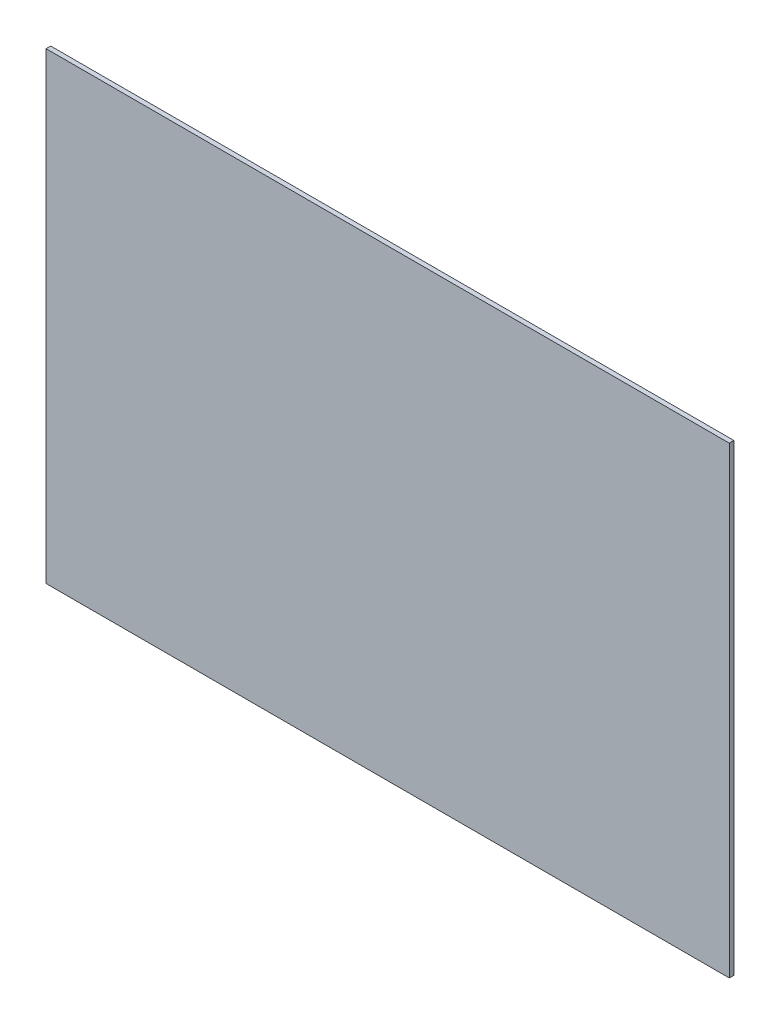
ISO-10303-21;
HEADER;
FILE_DESCRIPTION(('STEP AP214'),'2;1');
FILE_NAME('part.step','',(''),(''),'','','');
FILE_SCHEMA(('AUTOMOTIVE_DESIGN { 1 0 10303 214 1 1 1 1 }'));
ENDSEC;
DATA;
#1=APPLICATION_CONTEXT('core data for automotive mechanical design processes');
#2=APPLICATION_PROTOCOL_DEFINITION('international standard','automotive_design',2000,#1);
#3=PRODUCT_CONTEXT('',#1,'mechanical');
#4=PRODUCT('Part','Part','',(#3));
#5=PRODUCT_RELATED_PRODUCT_CATEGORY('part','',(#4));
#6=PRODUCT_DEFINITION_FORMATION('','',#4);
#7=PRODUCT_DEFINITION_CONTEXT('part definition',#1,'design');
#8=PRODUCT_DEFINITION('design','',#6,#7);
#9=PRODUCT_DEFINITION_SHAPE('','',#8);
#10=(LENGTH_UNIT() NAMED_UNIT(*) SI_UNIT(.MILLI.,.METRE.));
#11=(NAMED_UNIT(*) PLANE_ANGLE_UNIT() SI_UNIT($,.RADIAN.));
#12=(NAMED_UNIT(*) SI_UNIT($,.STERADIAN.) SOLID_ANGLE_UNIT());
#13=UNCERTAINTY_MEASURE_WITH_UNIT(LENGTH_MEASURE(1.E-05),#10,'distance_accuracy_value','');
#14=(GEOMETRIC_REPRESENTATION_CONTEXT(3) GLOBAL_UNCERTAINTY_ASSIGNED_CONTEXT((#13)) GLOBAL_UNIT_ASSIGNED_CONTEXT((#10,
#11,#12)) REPRESENTATION_CONTEXT('',''));
#15=CARTESIAN_POINT('',(0.,0.,0.));
#16=DIRECTION('',(0.,0.,1.));
#17=DIRECTION('',(1.,0.,0.));
#18=AXIS2_PLACEMENT_3D('',#15,#16,#17);
#19=CARTESIAN_POINT('',(0.,0.,2.));
#20=DIRECTION('',(1.,0.,0.));
#21=DIRECTION('',(0.,0.,-1.));
#22=AXIS2_PLACEMENT_3D('',#19,#20,#21);
#23=PLANE('',#22);
#24=DIRECTION('',(0.,-1.,0.));
#25=VECTOR('',#24,1.);
#26=CARTESIAN_POINT('',(0.,0.,0.));
#27=LINE('',#26,#25);
#28=CARTESIAN_POINT('',(0.,200.,0.));
#29=VERTEX_POINT('',#28);
#30=CARTESIAN_POINT('',(0.,0.,0.));
#31=VERTEX_POINT('',#30);
#32=EDGE_CURVE('E105',#29,#31,#27,.T.);
#33=ORIENTED_EDGE('',*,*,#32,.T.);
#34=DIRECTION('',(0.,0.,-1.));
#35=VECTOR('',#34,1.);
#36=CARTESIAN_POINT('',(0.,0.,2.));
#37=LINE('',#36,#35);
#38=CARTESIAN_POINT('',(0.,0.,2.));
#39=VERTEX_POINT('',#38);
#40=EDGE_CURVE('E11',#39,#31,#37,.T.);
#41=ORIENTED_EDGE('',*,*,#40,.F.);
#42=DIRECTION('',(0.,-1.,0.));
#43=VECTOR('',#42,1.);
#44=CARTESIAN_POINT('',(0.,0.,2.));
#45=LINE('',#44,#43);
#46=CARTESIAN_POINT('',(0.,200.,2.));
#47=VERTEX_POINT('',#46);
#48=EDGE_CURVE('E93',#47,#39,#45,.T.);
#49=ORIENTED_EDGE('',*,*,#48,.F.);
#50=DIRECTION('',(0.,0.,-1.));
#51=VECTOR('',#50,1.);
#52=CARTESIAN_POINT('',(0.,200.,2.));
#53=LINE('',#52,#51);
#54=EDGE_CURVE('E101',#47,#29,#53,.T.);
#55=ORIENTED_EDGE('',*,*,#54,.T.);
#56=EDGE_LOOP('',(#33,#41,#49,#55));
#57=FACE_BOUND('',#56,.T.);
#58=ADVANCED_FACE('F42',(#57),#23,.F.);
#59=CARTESIAN_POINT('',(0.,0.,2.));
#60=DIRECTION('',(0.,1.,0.));
#61=DIRECTION('',(0.,0.,1.));
#62=AXIS2_PLACEMENT_3D('',#59,#60,#61);
#63=PLANE('',#62);
#64=DIRECTION('',(1.,0.,0.));
#65=VECTOR('',#64,1.);
#66=CARTESIAN_POINT('',(0.,0.,0.));
#67=LINE('',#66,#65);
#68=CARTESIAN_POINT('',(295.,0.,0.));
#69=VERTEX_POINT('',#68);
#70=EDGE_CURVE('E97',#31,#69,#67,.T.);
#71=ORIENTED_EDGE('',*,*,#70,.T.);
#72=DIRECTION('',(0.,0.,-1.));
#73=VECTOR('',#72,1.);
#74=CARTESIAN_POINT('',(295.,0.,2.));
#75=LINE('',#74,#73);
#76=CARTESIAN_POINT('',(295.,0.,2.));
#77=VERTEX_POINT('',#76);
#78=EDGE_CURVE('E50',#77,#69,#75,.T.);
#79=ORIENTED_EDGE('',*,*,#78,.F.);
#80=DIRECTION('',(1.,0.,0.));
#81=VECTOR('',#80,1.);
#82=CARTESIAN_POINT('',(0.,0.,2.));
#83=LINE('',#82,#81);
#84=EDGE_CURVE('E88',#39,#77,#83,.T.);
#85=ORIENTED_EDGE('',*,*,#84,.F.);
#86=ORIENTED_EDGE('',*,*,#40,.T.);
#87=EDGE_LOOP('',(#71,#79,#85,#86));
#88=FACE_BOUND('',#87,.T.);
#89=ADVANCED_FACE('F96',(#88),#63,.F.);
#90=CARTESIAN_POINT('',(295.,0.,2.));
#91=DIRECTION('',(-1.,0.,0.));
#92=DIRECTION('',(0.,0.,1.));
#93=AXIS2_PLACEMENT_3D('',#90,#91,#92);
#94=PLANE('',#93);
#95=DIRECTION('',(0.,1.,0.));
#96=VECTOR('',#95,1.);
#97=CARTESIAN_POINT('',(295.,0.,0.));
#98=LINE('',#97,#96);
#99=CARTESIAN_POINT('',(295.,200.,0.));
#100=VERTEX_POINT('',#99);
#101=EDGE_CURVE('E75',#69,#100,#98,.T.);
#102=ORIENTED_EDGE('',*,*,#101,.T.);
#103=DIRECTION('',(0.,0.,-1.));
#104=VECTOR('',#103,1.);
#105=CARTESIAN_POINT('',(295.,200.,2.));
#106=LINE('',#105,#104);
#107=CARTESIAN_POINT('',(295.,200.,2.));
#108=VERTEX_POINT('',#107);
#109=EDGE_CURVE('E98',#108,#100,#106,.T.);
#110=ORIENTED_EDGE('',*,*,#109,.F.);
#111=DIRECTION('',(0.,1.,0.));
#112=VECTOR('',#111,1.);
#113=CARTESIAN_POINT('',(295.,0.,2.));
#114=LINE('',#113,#112);
#115=EDGE_CURVE('E91',#77,#108,#114,.T.);
#116=ORIENTED_EDGE('',*,*,#115,.F.);
#117=ORIENTED_EDGE('',*,*,#78,.T.);
#118=EDGE_LOOP('',(#102,#110,#116,#117));
#119=FACE_BOUND('',#118,.T.);
#120=ADVANCED_FACE('F99',(#119),#94,.F.);
#121=CARTESIAN_POINT('',(0.,200.,2.));
#122=DIRECTION('',(0.,-1.,0.));
#123=DIRECTION('',(0.,0.,-1.));
#124=AXIS2_PLACEMENT_3D('',#121,#122,#123);
#125=PLANE('',#124);
#126=DIRECTION('',(-1.,0.,0.));
#127=VECTOR('',#126,1.);
#128=CARTESIAN_POINT('',(0.,200.,0.));
#129=LINE('',#128,#127);
#130=EDGE_CURVE('E81',#100,#29,#129,.T.);
#131=ORIENTED_EDGE('',*,*,#130,.T.);
#132=ORIENTED_EDGE('',*,*,#54,.F.);
#133=DIRECTION('',(-1.,0.,0.));
#134=VECTOR('',#133,1.);
#135=CARTESIAN_POINT('',(0.,200.,2.));
#136=LINE('',#135,#134);
#137=EDGE_CURVE('E58',#108,#47,#136,.T.);
#138=ORIENTED_EDGE('',*,*,#137,.F.);
#139=ORIENTED_EDGE('',*,*,#109,.T.);
#140=EDGE_LOOP('',(#131,#132,#138,#139));
#141=FACE_BOUND('',#140,.T.);
#142=ADVANCED_FACE('F112',(#141),#125,.F.);
#143=CARTESIAN_POINT('',(0.,0.,2.));
#144=DIRECTION('',(0.,0.,-1.));
#145=DIRECTION('',(-1.,0.,0.));
#146=AXIS2_PLACEMENT_3D('',#143,#144,#145);
#147=PLANE('',#146);
#148=ORIENTED_EDGE('',*,*,#48,.T.);
#149=ORIENTED_EDGE('',*,*,#84,.T.);
#150=ORIENTED_EDGE('',*,*,#115,.T.);
#151=ORIENTED_EDGE('',*,*,#137,.T.);
#152=EDGE_LOOP('',(#148,#149,#150,#151));
#153=FACE_BOUND('',#152,.T.);
#154=ADVANCED_FACE('F89',(#153),#147,.F.);
#155=CARTESIAN_POINT('',(0.,0.,0.));
#156=DIRECTION('',(0.,0.,-1.));
#157=DIRECTION('',(-1.,0.,0.));
#158=AXIS2_PLACEMENT_3D('',#155,#156,#157);
#159=PLANE('',#158);
#160=ORIENTED_EDGE('',*,*,#32,.F.);
#161=ORIENTED_EDGE('',*,*,#130,.F.);
#162=ORIENTED_EDGE('',*,*,#101,.F.);
#163=ORIENTED_EDGE('',*,*,#70,.F.);
#164=EDGE_LOOP('',(#160,#161,#162,#163));
#165=FACE_BOUND('',#164,.T.);
#166=ADVANCED_FACE('F115',(#165),#159,.T.);
#167=CLOSED_SHELL('',(#58,#89,#120,#142,#154,#166));
#168=MANIFOLD_SOLID_BREP('B2',#167);
#169=ADVANCED_BREP_SHAPE_REPRESENTATION('',(#18,#168),#14);
#170=SHAPE_DEFINITION_REPRESENTATION(#9,#169);
ENDSEC;
END-ISO-10303-21;
